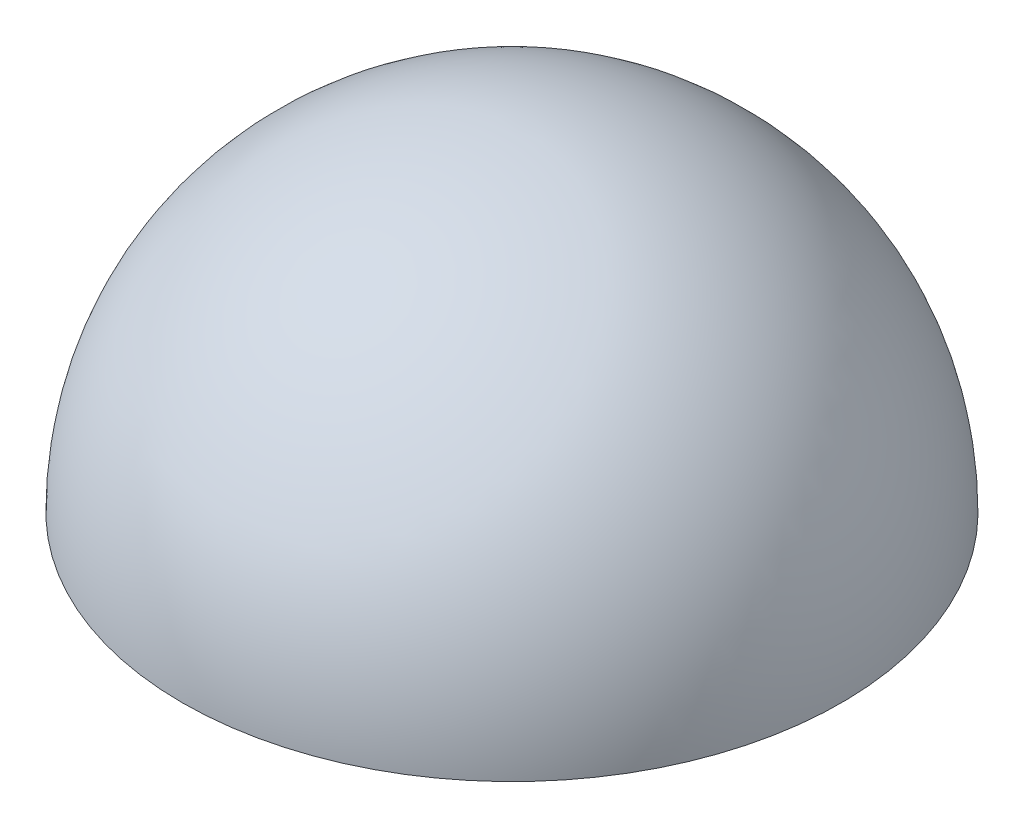
ISO-10303-21;
HEADER;
FILE_DESCRIPTION(('STEP AP214'),'2;1');
FILE_NAME('part.step','',(''),(''),'','','');
FILE_SCHEMA(('AUTOMOTIVE_DESIGN { 1 0 10303 214 1 1 1 1 }'));
ENDSEC;
DATA;
#1=APPLICATION_CONTEXT('core data for automotive mechanical design processes');
#2=APPLICATION_PROTOCOL_DEFINITION('international standard','automotive_design',2000,#1);
#3=PRODUCT_CONTEXT('',#1,'mechanical');
#4=PRODUCT('Part','Part','',(#3));
#5=PRODUCT_RELATED_PRODUCT_CATEGORY('part','',(#4));
#6=PRODUCT_DEFINITION_FORMATION('','',#4);
#7=PRODUCT_DEFINITION_CONTEXT('part definition',#1,'design');
#8=PRODUCT_DEFINITION('design','',#6,#7);
#9=PRODUCT_DEFINITION_SHAPE('','',#8);
#10=(LENGTH_UNIT() NAMED_UNIT(*) SI_UNIT(.MILLI.,.METRE.));
#11=(NAMED_UNIT(*) PLANE_ANGLE_UNIT() SI_UNIT($,.RADIAN.));
#12=(NAMED_UNIT(*) SI_UNIT($,.STERADIAN.) SOLID_ANGLE_UNIT());
#13=UNCERTAINTY_MEASURE_WITH_UNIT(LENGTH_MEASURE(1.E-05),#10,'distance_accuracy_value','');
#14=(GEOMETRIC_REPRESENTATION_CONTEXT(3) GLOBAL_UNCERTAINTY_ASSIGNED_CONTEXT((#13)) GLOBAL_UNIT_ASSIGNED_CONTEXT((#10,
#11,#12)) REPRESENTATION_CONTEXT('',''));
#15=CARTESIAN_POINT('',(0.,0.,0.));
#16=DIRECTION('',(0.,0.,1.));
#17=DIRECTION('',(1.,0.,0.));
#18=AXIS2_PLACEMENT_3D('',#15,#16,#17);
#19=CARTESIAN_POINT('',(0.,0.,0.));
#20=DIRECTION('',(0.,0.,-1.));
#21=DIRECTION('',(1.,0.,0.));
#22=AXIS2_PLACEMENT_3D('',#19,#20,#21);
#23=SPHERICAL_SURFACE('',#22,7.5);
#24=CARTESIAN_POINT('',(0.,0.,0.));
#25=DIRECTION('',(0.,1.,0.));
#26=DIRECTION('',(0.,0.,1.));
#27=AXIS2_PLACEMENT_3D('',#24,#25,#26);
#28=SPHERICAL_SURFACE('',#27,7.5);
#29=CARTESIAN_POINT('',(0.,0.,0.));
#30=DIRECTION('',(0.,1.,0.));
#31=DIRECTION('',(0.,0.,1.));
#32=AXIS2_PLACEMENT_3D('',#29,#30,#31);
#33=CIRCLE('',#32,7.5);
#34=CARTESIAN_POINT('',(0.,0.,7.5));
#35=VERTEX_POINT('',#34);
#36=EDGE_CURVE('E45',#35,#35,#33,.T.);
#37=ORIENTED_EDGE('',*,*,#36,.F.);
#38=EDGE_LOOP('',(#37));
#39=FACE_BOUND('',#38,.T.);
#40=ADVANCED_FACE('F37',(#39),#28,.F.);
#41=CARTESIAN_POINT('',(0.,0.,0.));
#42=DIRECTION('',(0.,0.,-1.));
#43=DIRECTION('',(-1.,0.,0.));
#44=AXIS2_PLACEMENT_3D('',#41,#42,#43);
#45=SPHERICAL_SURFACE('',#44,12.5);
#46=CARTESIAN_POINT('',(0.,0.,0.));
#47=DIRECTION('',(0.,-1.,0.));
#48=DIRECTION('',(0.,0.,1.));
#49=AXIS2_PLACEMENT_3D('',#46,#47,#48);
#50=SPHERICAL_SURFACE('',#49,12.5);
#51=CARTESIAN_POINT('',(0.,0.,0.));
#52=DIRECTION('',(0.,-1.,0.));
#53=DIRECTION('',(0.,0.,1.));
#54=AXIS2_PLACEMENT_3D('',#51,#52,#53);
#55=CIRCLE('',#54,12.5);
#56=CARTESIAN_POINT('',(0.,0.,12.5));
#57=VERTEX_POINT('',#56);
#58=EDGE_CURVE('E10',#57,#57,#55,.T.);
#59=ORIENTED_EDGE('',*,*,#58,.F.);
#60=EDGE_LOOP('',(#59));
#61=FACE_BOUND('',#60,.T.);
#62=ADVANCED_FACE('F39',(#61),#50,.T.);
#63=CARTESIAN_POINT('',(0.,0.,0.));
#64=DIRECTION('',(0.,-1.,0.));
#65=DIRECTION('',(0.,0.,1.));
#66=AXIS2_PLACEMENT_3D('',#63,#64,#65);
#67=PLANE('',#66);
#68=ORIENTED_EDGE('',*,*,#58,.T.);
#69=EDGE_LOOP('',(#68));
#70=FACE_BOUND('',#69,.T.);
#71=ORIENTED_EDGE('',*,*,#36,.T.);
#72=EDGE_LOOP('',(#71));
#73=FACE_BOUND('',#72,.T.);
#74=ADVANCED_FACE('F52',(#70,#73),#67,.T.);
#75=CLOSED_SHELL('',(#40,#62,#74));
#76=MANIFOLD_SOLID_BREP('B2',#75);
#77=ADVANCED_BREP_SHAPE_REPRESENTATION('',(#18,#76),#14);
#78=SHAPE_DEFINITION_REPRESENTATION(#9,#77);
ENDSEC;
END-ISO-10303-21;
